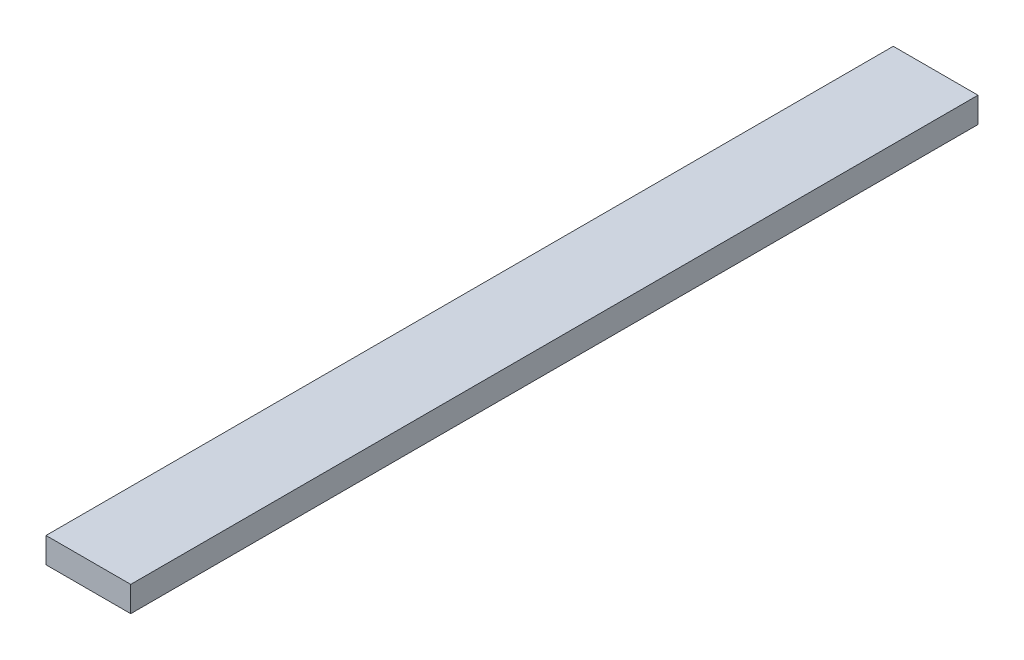
ISO-10303-21;
HEADER;
FILE_DESCRIPTION(('STEP AP214'),'2;1');
FILE_NAME('part.step','',(''),(''),'','','');
FILE_SCHEMA(('AUTOMOTIVE_DESIGN { 1 0 10303 214 1 1 1 1 }'));
ENDSEC;
DATA;
#1=APPLICATION_CONTEXT('core data for automotive mechanical design processes');
#2=APPLICATION_PROTOCOL_DEFINITION('international standard','automotive_design',2000,#1);
#3=PRODUCT_CONTEXT('',#1,'mechanical');
#4=PRODUCT('Part','Part','',(#3));
#5=PRODUCT_RELATED_PRODUCT_CATEGORY('part','',(#4));
#6=PRODUCT_DEFINITION_FORMATION('','',#4);
#7=PRODUCT_DEFINITION_CONTEXT('part definition',#1,'design');
#8=PRODUCT_DEFINITION('design','',#6,#7);
#9=PRODUCT_DEFINITION_SHAPE('','',#8);
#10=(LENGTH_UNIT() NAMED_UNIT(*) SI_UNIT(.MILLI.,.METRE.));
#11=(NAMED_UNIT(*) PLANE_ANGLE_UNIT() SI_UNIT($,.RADIAN.));
#12=(NAMED_UNIT(*) SI_UNIT($,.STERADIAN.) SOLID_ANGLE_UNIT());
#13=UNCERTAINTY_MEASURE_WITH_UNIT(LENGTH_MEASURE(1.E-05),#10,'distance_accuracy_value','');
#14=(GEOMETRIC_REPRESENTATION_CONTEXT(3) GLOBAL_UNCERTAINTY_ASSIGNED_CONTEXT((#13)) GLOBAL_UNIT_ASSIGNED_CONTEXT((#10,
#11,#12)) REPRESENTATION_CONTEXT('',''));
#15=CARTESIAN_POINT('',(0.,0.,0.));
#16=DIRECTION('',(0.,0.,1.));
#17=DIRECTION('',(1.,0.,0.));
#18=AXIS2_PLACEMENT_3D('',#15,#16,#17);
#19=CARTESIAN_POINT('',(50.,-7.50000000000003,250.));
#20=DIRECTION('',(0.,0.,-1.));
#21=DIRECTION('',(-1.,0.,0.));
#22=AXIS2_PLACEMENT_3D('',#19,#20,#21);
#23=PLANE('',#22);
#24=DIRECTION('',(0.,-1.,0.));
#25=VECTOR('',#24,1.);
#26=CARTESIAN_POINT('',(0.,-7.50000000000003,250.));
#27=LINE('',#26,#25);
#28=CARTESIAN_POINT('',(0.,7.49999999999997,250.));
#29=VERTEX_POINT('',#28);
#30=CARTESIAN_POINT('',(0.,-7.50000000000003,250.));
#31=VERTEX_POINT('',#30);
#32=EDGE_CURVE('E111',#29,#31,#27,.T.);
#33=ORIENTED_EDGE('',*,*,#32,.T.);
#34=DIRECTION('',(-1.,0.,0.));
#35=VECTOR('',#34,1.);
#36=CARTESIAN_POINT('',(50.,-7.50000000000003,250.));
#37=LINE('',#36,#35);
#38=CARTESIAN_POINT('',(50.,-7.50000000000003,250.));
#39=VERTEX_POINT('',#38);
#40=EDGE_CURVE('E11',#39,#31,#37,.T.);
#41=ORIENTED_EDGE('',*,*,#40,.F.);
#42=DIRECTION('',(0.,-1.,0.));
#43=VECTOR('',#42,1.);
#44=CARTESIAN_POINT('',(50.,-7.50000000000003,250.));
#45=LINE('',#44,#43);
#46=CARTESIAN_POINT('',(50.,7.49999999999997,250.));
#47=VERTEX_POINT('',#46);
#48=EDGE_CURVE('E95',#47,#39,#45,.T.);
#49=ORIENTED_EDGE('',*,*,#48,.F.);
#50=DIRECTION('',(-1.,0.,0.));
#51=VECTOR('',#50,1.);
#52=CARTESIAN_POINT('',(50.,7.49999999999997,250.));
#53=LINE('',#52,#51);
#54=EDGE_CURVE('E107',#47,#29,#53,.T.);
#55=ORIENTED_EDGE('',*,*,#54,.T.);
#56=EDGE_LOOP('',(#33,#41,#49,#55));
#57=FACE_BOUND('',#56,.T.);
#58=ADVANCED_FACE('F43',(#57),#23,.F.);
#59=CARTESIAN_POINT('',(50.,-7.49999999999997,-250.));
#60=DIRECTION('',(0.,1.,0.));
#61=DIRECTION('',(0.,0.,1.));
#62=AXIS2_PLACEMENT_3D('',#59,#60,#61);
#63=PLANE('',#62);
#64=DIRECTION('',(0.,0.,-1.));
#65=VECTOR('',#64,1.);
#66=CARTESIAN_POINT('',(0.,-7.49999999999997,-250.));
#67=LINE('',#66,#65);
#68=CARTESIAN_POINT('',(0.,-7.49999999999997,-250.));
#69=VERTEX_POINT('',#68);
#70=EDGE_CURVE('E100',#31,#69,#67,.T.);
#71=ORIENTED_EDGE('',*,*,#70,.T.);
#72=DIRECTION('',(-1.,0.,0.));
#73=VECTOR('',#72,1.);
#74=CARTESIAN_POINT('',(50.,-7.49999999999997,-250.));
#75=LINE('',#74,#73);
#76=CARTESIAN_POINT('',(50.,-7.49999999999997,-250.));
#77=VERTEX_POINT('',#76);
#78=EDGE_CURVE('E52',#77,#69,#75,.T.);
#79=ORIENTED_EDGE('',*,*,#78,.F.);
#80=DIRECTION('',(0.,0.,-1.));
#81=VECTOR('',#80,1.);
#82=CARTESIAN_POINT('',(50.,-7.49999999999997,-250.));
#83=LINE('',#82,#81);
#84=EDGE_CURVE('E90',#39,#77,#83,.T.);
#85=ORIENTED_EDGE('',*,*,#84,.F.);
#86=ORIENTED_EDGE('',*,*,#40,.T.);
#87=EDGE_LOOP('',(#71,#79,#85,#86));
#88=FACE_BOUND('',#87,.T.);
#89=ADVANCED_FACE('F99',(#88),#63,.F.);
#90=CARTESIAN_POINT('',(50.,-7.49999999999997,-250.));
#91=DIRECTION('',(0.,0.,1.));
#92=DIRECTION('',(1.,0.,0.));
#93=AXIS2_PLACEMENT_3D('',#90,#91,#92);
#94=PLANE('',#93);
#95=DIRECTION('',(0.,1.,0.));
#96=VECTOR('',#95,1.);
#97=CARTESIAN_POINT('',(0.,-7.49999999999997,-250.));
#98=LINE('',#97,#96);
#99=CARTESIAN_POINT('',(0.,7.50000000000003,-250.));
#100=VERTEX_POINT('',#99);
#101=EDGE_CURVE('E77',#69,#100,#98,.T.);
#102=ORIENTED_EDGE('',*,*,#101,.T.);
#103=DIRECTION('',(-1.,0.,0.));
#104=VECTOR('',#103,1.);
#105=CARTESIAN_POINT('',(50.,7.50000000000003,-250.));
#106=LINE('',#105,#104);
#107=CARTESIAN_POINT('',(50.,7.50000000000003,-250.));
#108=VERTEX_POINT('',#107);
#109=EDGE_CURVE('E102',#108,#100,#106,.T.);
#110=ORIENTED_EDGE('',*,*,#109,.F.);
#111=DIRECTION('',(0.,1.,0.));
#112=VECTOR('',#111,1.);
#113=CARTESIAN_POINT('',(50.,-7.49999999999997,-250.));
#114=LINE('',#113,#112);
#115=EDGE_CURVE('E93',#77,#108,#114,.T.);
#116=ORIENTED_EDGE('',*,*,#115,.F.);
#117=ORIENTED_EDGE('',*,*,#78,.T.);
#118=EDGE_LOOP('',(#102,#110,#116,#117));
#119=FACE_BOUND('',#118,.T.);
#120=ADVANCED_FACE('F103',(#119),#94,.F.);
#121=CARTESIAN_POINT('',(50.,7.50000000000003,-250.));
#122=DIRECTION('',(0.,-1.,0.));
#123=DIRECTION('',(0.,0.,-1.));
#124=AXIS2_PLACEMENT_3D('',#121,#122,#123);
#125=PLANE('',#124);
#126=DIRECTION('',(0.,0.,1.));
#127=VECTOR('',#126,1.);
#128=CARTESIAN_POINT('',(0.,7.50000000000003,-250.));
#129=LINE('',#128,#127);
#130=EDGE_CURVE('E83',#100,#29,#129,.T.);
#131=ORIENTED_EDGE('',*,*,#130,.T.);
#132=ORIENTED_EDGE('',*,*,#54,.F.);
#133=DIRECTION('',(0.,0.,1.));
#134=VECTOR('',#133,1.);
#135=CARTESIAN_POINT('',(50.,7.50000000000003,-250.));
#136=LINE('',#135,#134);
#137=EDGE_CURVE('E60',#108,#47,#136,.T.);
#138=ORIENTED_EDGE('',*,*,#137,.F.);
#139=ORIENTED_EDGE('',*,*,#109,.T.);
#140=EDGE_LOOP('',(#131,#132,#138,#139));
#141=FACE_BOUND('',#140,.T.);
#142=ADVANCED_FACE('F124',(#141),#125,.F.);
#143=CARTESIAN_POINT('',(50.,0.,0.));
#144=DIRECTION('',(1.,0.,0.));
#145=DIRECTION('',(0.,0.,-1.));
#146=AXIS2_PLACEMENT_3D('',#143,#144,#145);
#147=PLANE('',#146);
#148=ORIENTED_EDGE('',*,*,#48,.T.);
#149=ORIENTED_EDGE('',*,*,#84,.T.);
#150=ORIENTED_EDGE('',*,*,#115,.T.);
#151=ORIENTED_EDGE('',*,*,#137,.T.);
#152=EDGE_LOOP('',(#148,#149,#150,#151));
#153=FACE_BOUND('',#152,.T.);
#154=ADVANCED_FACE('F91',(#153),#147,.T.);
#155=CARTESIAN_POINT('',(0.,0.,0.));
#156=DIRECTION('',(1.,0.,0.));
#157=DIRECTION('',(0.,0.,-1.));
#158=AXIS2_PLACEMENT_3D('',#155,#156,#157);
#159=PLANE('',#158);
#160=ORIENTED_EDGE('',*,*,#32,.F.);
#161=ORIENTED_EDGE('',*,*,#130,.F.);
#162=ORIENTED_EDGE('',*,*,#101,.F.);
#163=ORIENTED_EDGE('',*,*,#70,.F.);
#164=EDGE_LOOP('',(#160,#161,#162,#163));
#165=FACE_BOUND('',#164,.T.);
#166=ADVANCED_FACE('F127',(#165),#159,.F.);
#167=CLOSED_SHELL('',(#58,#89,#120,#142,#154,#166));
#168=MANIFOLD_SOLID_BREP('B2',#167);
#169=ADVANCED_BREP_SHAPE_REPRESENTATION('',(#18,#168),#14);
#170=SHAPE_DEFINITION_REPRESENTATION(#9,#169);
ENDSEC;
END-ISO-10303-21;
